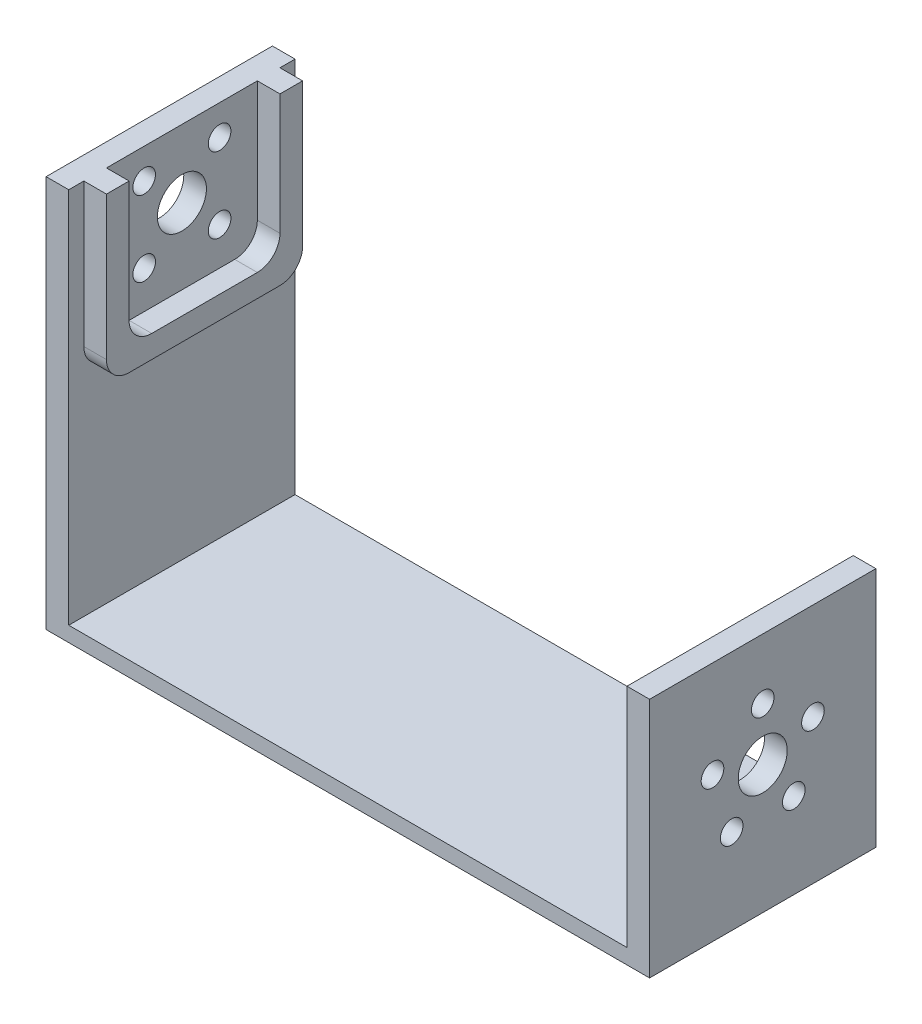
ISO-10303-21;
HEADER;
FILE_DESCRIPTION(('STEP AP214'),'2;1');
FILE_NAME('part.step','',(''),(''),'','','');
FILE_SCHEMA(('AUTOMOTIVE_DESIGN { 1 0 10303 214 1 1 1 1 }'));
ENDSEC;
DATA;
#1=APPLICATION_CONTEXT('core data for automotive mechanical design processes');
#2=APPLICATION_PROTOCOL_DEFINITION('international standard','automotive_design',2000,#1);
#3=PRODUCT_CONTEXT('',#1,'mechanical');
#4=PRODUCT('Part','Part','',(#3));
#5=PRODUCT_RELATED_PRODUCT_CATEGORY('part','',(#4));
#6=PRODUCT_DEFINITION_FORMATION('','',#4);
#7=PRODUCT_DEFINITION_CONTEXT('part definition',#1,'design');
#8=PRODUCT_DEFINITION('design','',#6,#7);
#9=PRODUCT_DEFINITION_SHAPE('','',#8);
#10=(LENGTH_UNIT() NAMED_UNIT(*) SI_UNIT(.MILLI.,.METRE.));
#11=(NAMED_UNIT(*) PLANE_ANGLE_UNIT() SI_UNIT($,.RADIAN.));
#12=(NAMED_UNIT(*) SI_UNIT($,.STERADIAN.) SOLID_ANGLE_UNIT());
#13=UNCERTAINTY_MEASURE_WITH_UNIT(LENGTH_MEASURE(1.E-05),#10,'distance_accuracy_value','');
#14=(GEOMETRIC_REPRESENTATION_CONTEXT(3) GLOBAL_UNCERTAINTY_ASSIGNED_CONTEXT((#13)) GLOBAL_UNIT_ASSIGNED_CONTEXT((#10,
#11,#12)) REPRESENTATION_CONTEXT('',''));
#15=CARTESIAN_POINT('',(0.,0.,0.));
#16=DIRECTION('',(0.,0.,1.));
#17=DIRECTION('',(1.,0.,0.));
#18=AXIS2_PLACEMENT_3D('',#15,#16,#17);
#19=CARTESIAN_POINT('',(-37.,52.,-15.));
#20=DIRECTION('',(-1.,0.,0.));
#21=DIRECTION('',(0.,0.,1.));
#22=AXIS2_PLACEMENT_3D('',#19,#20,#21);
#23=PLANE('',#22);
#24=DIRECTION('',(0.,-1.,0.));
#25=VECTOR('',#24,1.);
#26=CARTESIAN_POINT('',(-37.,52.,13.));
#27=LINE('',#26,#25);
#28=CARTESIAN_POINT('',(-37.,52.,13.));
#29=VERTEX_POINT('',#28);
#30=CARTESIAN_POINT('',(-37.,33.,13.));
#31=VERTEX_POINT('',#30);
#32=EDGE_CURVE('E226',#29,#31,#27,.T.);
#33=ORIENTED_EDGE('',*,*,#32,.F.);
#34=DIRECTION('',(0.,0.,-1.));
#35=VECTOR('',#34,1.);
#36=CARTESIAN_POINT('',(-37.,52.,-15.));
#37=LINE('',#36,#35);
#38=CARTESIAN_POINT('',(-37.,52.,15.));
#39=VERTEX_POINT('',#38);
#40=EDGE_CURVE('E377',#39,#29,#37,.T.);
#41=ORIENTED_EDGE('',*,*,#40,.F.);
#42=DIRECTION('',(0.,-1.,0.));
#43=VECTOR('',#42,1.);
#44=CARTESIAN_POINT('',(-37.,52.,15.));
#45=LINE('',#44,#43);
#46=CARTESIAN_POINT('',(-37.,2.,15.));
#47=VERTEX_POINT('',#46);
#48=EDGE_CURVE('E393',#39,#47,#45,.T.);
#49=ORIENTED_EDGE('',*,*,#48,.T.);
#50=DIRECTION('',(0.,0.,-1.));
#51=VECTOR('',#50,1.);
#52=CARTESIAN_POINT('',(-37.,2.,-15.));
#53=LINE('',#52,#51);
#54=CARTESIAN_POINT('',(-37.,2.,-15.));
#55=VERTEX_POINT('',#54);
#56=EDGE_CURVE('E369',#47,#55,#53,.T.);
#57=ORIENTED_EDGE('',*,*,#56,.T.);
#58=DIRECTION('',(0.,-1.,0.));
#59=VECTOR('',#58,1.);
#60=CARTESIAN_POINT('',(-37.,52.,-15.));
#61=LINE('',#60,#59);
#62=CARTESIAN_POINT('',(-37.,52.,-15.));
#63=VERTEX_POINT('',#62);
#64=EDGE_CURVE('E386',#63,#55,#61,.T.);
#65=ORIENTED_EDGE('',*,*,#64,.F.);
#66=CARTESIAN_POINT('',(-37.,52.,-13.));
#67=VERTEX_POINT('',#66);
#68=EDGE_CURVE('E376',#67,#63,#37,.T.);
#69=ORIENTED_EDGE('',*,*,#68,.F.);
#70=DIRECTION('',(0.,1.,0.));
#71=VECTOR('',#70,1.);
#72=CARTESIAN_POINT('',(-37.,30.,-13.));
#73=LINE('',#72,#71);
#74=CARTESIAN_POINT('',(-37.,33.,-13.));
#75=VERTEX_POINT('',#74);
#76=EDGE_CURVE('E197',#75,#67,#73,.T.);
#77=ORIENTED_EDGE('',*,*,#76,.F.);
#78=CARTESIAN_POINT('',(-37.,33.,-9.99999999999999));
#79=DIRECTION('',(-1.,0.,0.));
#80=DIRECTION('',(0.,0.,1.));
#81=AXIS2_PLACEMENT_3D('',#78,#79,#80);
#82=CIRCLE('',#81,3.);
#83=CARTESIAN_POINT('',(-37.,30.,-10.));
#84=VERTEX_POINT('',#83);
#85=EDGE_CURVE('E467',#75,#84,#82,.T.);
#86=ORIENTED_EDGE('',*,*,#85,.T.);
#87=DIRECTION('',(0.,0.,-1.));
#88=VECTOR('',#87,1.);
#89=CARTESIAN_POINT('',(-37.,30.,13.));
#90=LINE('',#89,#88);
#91=CARTESIAN_POINT('',(-37.,30.,10.));
#92=VERTEX_POINT('',#91);
#93=EDGE_CURVE('E230',#92,#84,#90,.T.);
#94=ORIENTED_EDGE('',*,*,#93,.F.);
#95=CARTESIAN_POINT('',(-37.,33.,10.));
#96=DIRECTION('',(-1.,0.,0.));
#97=DIRECTION('',(0.,0.,1.));
#98=AXIS2_PLACEMENT_3D('',#95,#96,#97);
#99=CIRCLE('',#98,3.);
#100=EDGE_CURVE('E470',#92,#31,#99,.T.);
#101=ORIENTED_EDGE('',*,*,#100,.T.);
#102=EDGE_LOOP('',(#33,#41,#49,#57,#65,#69,#77,#86,#94,#101));
#103=FACE_BOUND('',#102,.T.);
#104=ADVANCED_FACE('F39',(#103),#23,.F.);
#105=CARTESIAN_POINT('',(-37.,48.,-5.));
#106=DIRECTION('',(1.,0.,0.));
#107=DIRECTION('',(0.,0.,-1.));
#108=AXIS2_PLACEMENT_3D('',#105,#106,#107);
#109=CIRCLE('',#108,1.5);
#110=CARTESIAN_POINT('',(-37.,48.,-6.5));
#111=VERTEX_POINT('',#110);
#112=EDGE_CURVE('E323',#111,#111,#109,.T.);
#113=ORIENTED_EDGE('',*,*,#112,.F.);
#114=EDGE_LOOP('',(#113));
#115=FACE_BOUND('',#114,.T.);
#116=CARTESIAN_POINT('',(-37.,43.,0.));
#117=DIRECTION('',(1.,0.,0.));
#118=DIRECTION('',(0.,0.,-1.));
#119=AXIS2_PLACEMENT_3D('',#116,#117,#118);
#120=CIRCLE('',#119,3.25);
#121=CARTESIAN_POINT('',(-37.,43.,-3.25));
#122=VERTEX_POINT('',#121);
#123=EDGE_CURVE('E302',#122,#122,#120,.T.);
#124=ORIENTED_EDGE('',*,*,#123,.F.);
#125=EDGE_LOOP('',(#124));
#126=FACE_BOUND('',#125,.T.);
#127=CARTESIAN_POINT('',(-37.,38.,5.));
#128=DIRECTION('',(1.,0.,0.));
#129=DIRECTION('',(0.,0.,-1.));
#130=AXIS2_PLACEMENT_3D('',#127,#128,#129);
#131=CIRCLE('',#130,1.5);
#132=CARTESIAN_POINT('',(-37.,38.,3.5));
#133=VERTEX_POINT('',#132);
#134=EDGE_CURVE('E308',#133,#133,#131,.T.);
#135=ORIENTED_EDGE('',*,*,#134,.F.);
#136=EDGE_LOOP('',(#135));
#137=FACE_BOUND('',#136,.T.);
#138=CARTESIAN_POINT('',(-37.,38.,-5.));
#139=DIRECTION('',(1.,0.,0.));
#140=DIRECTION('',(0.,0.,-1.));
#141=AXIS2_PLACEMENT_3D('',#138,#139,#140);
#142=CIRCLE('',#141,1.5);
#143=CARTESIAN_POINT('',(-37.,38.,-6.5));
#144=VERTEX_POINT('',#143);
#145=EDGE_CURVE('E307',#144,#144,#142,.T.);
#146=ORIENTED_EDGE('',*,*,#145,.F.);
#147=EDGE_LOOP('',(#146));
#148=FACE_BOUND('',#147,.T.);
#149=CARTESIAN_POINT('',(-37.,48.,5.));
#150=DIRECTION('',(1.,0.,0.));
#151=DIRECTION('',(0.,0.,-1.));
#152=AXIS2_PLACEMENT_3D('',#149,#150,#151);
#153=CIRCLE('',#152,1.5);
#154=CARTESIAN_POINT('',(-37.,48.,3.5));
#155=VERTEX_POINT('',#154);
#156=EDGE_CURVE('E324',#155,#155,#153,.T.);
#157=ORIENTED_EDGE('',*,*,#156,.F.);
#158=EDGE_LOOP('',(#157));
#159=FACE_BOUND('',#158,.T.);
#160=DIRECTION('',(0.,0.,1.));
#161=VECTOR('',#160,1.);
#162=CARTESIAN_POINT('',(-37.,33.,9.99999999999999));
#163=LINE('',#162,#161);
#164=CARTESIAN_POINT('',(-37.,33.,-7.));
#165=VERTEX_POINT('',#164);
#166=CARTESIAN_POINT('',(-37.,33.,6.99999999999999));
#167=VERTEX_POINT('',#166);
#168=EDGE_CURVE('E239',#165,#167,#163,.T.);
#169=ORIENTED_EDGE('',*,*,#168,.F.);
#170=CARTESIAN_POINT('',(-37.,36.,-7.));
#171=DIRECTION('',(-1.,0.,0.));
#172=DIRECTION('',(0.,0.,1.));
#173=AXIS2_PLACEMENT_3D('',#170,#171,#172);
#174=CIRCLE('',#173,3.);
#175=CARTESIAN_POINT('',(-37.,36.,-9.99999999999999));
#176=VERTEX_POINT('',#175);
#177=EDGE_CURVE('E63',#165,#176,#174,.F.);
#178=ORIENTED_EDGE('',*,*,#177,.T.);
#179=DIRECTION('',(0.,-1.,0.));
#180=VECTOR('',#179,1.);
#181=CARTESIAN_POINT('',(-37.,33.,-9.99999999999999));
#182=LINE('',#181,#180);
#183=CARTESIAN_POINT('',(-37.,52.,-9.99999999999999));
#184=VERTEX_POINT('',#183);
#185=EDGE_CURVE('E236',#184,#176,#182,.T.);
#186=ORIENTED_EDGE('',*,*,#185,.F.);
#187=CARTESIAN_POINT('',(-37.,52.,9.99999999999999));
#188=VERTEX_POINT('',#187);
#189=EDGE_CURVE('E382',#188,#184,#37,.T.);
#190=ORIENTED_EDGE('',*,*,#189,.F.);
#191=DIRECTION('',(0.,1.,0.));
#192=VECTOR('',#191,1.);
#193=CARTESIAN_POINT('',(-37.,52.,9.99999999999999));
#194=LINE('',#193,#192);
#195=CARTESIAN_POINT('',(-37.,36.,9.99999999999999));
#196=VERTEX_POINT('',#195);
#197=EDGE_CURVE('E243',#196,#188,#194,.T.);
#198=ORIENTED_EDGE('',*,*,#197,.F.);
#199=CARTESIAN_POINT('',(-37.,36.,6.99999999999999));
#200=DIRECTION('',(-1.,0.,0.));
#201=DIRECTION('',(0.,0.,1.));
#202=AXIS2_PLACEMENT_3D('',#199,#200,#201);
#203=CIRCLE('',#202,3.);
#204=EDGE_CURVE('E55',#196,#167,#203,.F.);
#205=ORIENTED_EDGE('',*,*,#204,.T.);
#206=EDGE_LOOP('',(#169,#178,#186,#190,#198,#205));
#207=FACE_BOUND('',#206,.T.);
#208=ADVANCED_FACE('F485',(#115,#126,#137,#148,#159,#207),#23,.F.);
#209=CARTESIAN_POINT('',(0.,2.,0.));
#210=DIRECTION('',(0.,1.,0.));
#211=DIRECTION('',(0.,0.,1.));
#212=AXIS2_PLACEMENT_3D('',#209,#210,#211);
#213=PLANE('',#212);
#214=DIRECTION('',(1.,0.,0.));
#215=VECTOR('',#214,1.);
#216=CARTESIAN_POINT('',(40.,2.,15.));
#217=LINE('',#216,#215);
#218=CARTESIAN_POINT('',(37.,2.,15.));
#219=VERTEX_POINT('',#218);
#220=EDGE_CURVE('E398',#47,#219,#217,.T.);
#221=ORIENTED_EDGE('',*,*,#220,.T.);
#222=DIRECTION('',(0.,0.,1.));
#223=VECTOR('',#222,1.);
#224=CARTESIAN_POINT('',(37.,2.,-15.));
#225=LINE('',#224,#223);
#226=CARTESIAN_POINT('',(37.,2.,-15.));
#227=VERTEX_POINT('',#226);
#228=EDGE_CURVE('E339',#227,#219,#225,.T.);
#229=ORIENTED_EDGE('',*,*,#228,.F.);
#230=DIRECTION('',(-1.,0.,0.));
#231=VECTOR('',#230,1.);
#232=CARTESIAN_POINT('',(40.,2.,-15.));
#233=LINE('',#232,#231);
#234=EDGE_CURVE('E401',#227,#55,#233,.T.);
#235=ORIENTED_EDGE('',*,*,#234,.T.);
#236=ORIENTED_EDGE('',*,*,#56,.F.);
#237=EDGE_LOOP('',(#221,#229,#235,#236));
#238=FACE_BOUND('',#237,.T.);
#239=ADVANCED_FACE('F546',(#238),#213,.T.);
#240=CARTESIAN_POINT('',(-40.,2.,15.));
#241=DIRECTION('',(1.,0.,0.));
#242=DIRECTION('',(0.,0.,-1.));
#243=AXIS2_PLACEMENT_3D('',#240,#241,#242);
#244=PLANE('',#243);
#245=CARTESIAN_POINT('',(-40.,48.,5.));
#246=DIRECTION('',(1.,0.,0.));
#247=DIRECTION('',(0.,0.,-1.));
#248=AXIS2_PLACEMENT_3D('',#245,#246,#247);
#249=CIRCLE('',#248,1.5);
#250=CARTESIAN_POINT('',(-40.,48.,3.5));
#251=VERTEX_POINT('',#250);
#252=EDGE_CURVE('E319',#251,#251,#249,.T.);
#253=ORIENTED_EDGE('',*,*,#252,.T.);
#254=EDGE_LOOP('',(#253));
#255=FACE_BOUND('',#254,.T.);
#256=CARTESIAN_POINT('',(-40.,38.,-5.));
#257=DIRECTION('',(1.,0.,0.));
#258=DIRECTION('',(0.,0.,-1.));
#259=AXIS2_PLACEMENT_3D('',#256,#257,#258);
#260=CIRCLE('',#259,1.5);
#261=CARTESIAN_POINT('',(-40.,38.,-6.5));
#262=VERTEX_POINT('',#261);
#263=EDGE_CURVE('E328',#262,#262,#260,.T.);
#264=ORIENTED_EDGE('',*,*,#263,.T.);
#265=EDGE_LOOP('',(#264));
#266=FACE_BOUND('',#265,.T.);
#267=CARTESIAN_POINT('',(-40.,38.,5.));
#268=DIRECTION('',(1.,0.,0.));
#269=DIRECTION('',(0.,0.,-1.));
#270=AXIS2_PLACEMENT_3D('',#267,#268,#269);
#271=CIRCLE('',#270,1.5);
#272=CARTESIAN_POINT('',(-40.,38.,3.5));
#273=VERTEX_POINT('',#272);
#274=EDGE_CURVE('E303',#273,#273,#271,.T.);
#275=ORIENTED_EDGE('',*,*,#274,.T.);
#276=EDGE_LOOP('',(#275));
#277=FACE_BOUND('',#276,.T.);
#278=CARTESIAN_POINT('',(-40.,43.,0.));
#279=DIRECTION('',(1.,0.,0.));
#280=DIRECTION('',(0.,0.,-1.));
#281=AXIS2_PLACEMENT_3D('',#278,#279,#280);
#282=CIRCLE('',#281,3.25);
#283=CARTESIAN_POINT('',(-40.,43.,-3.25));
#284=VERTEX_POINT('',#283);
#285=EDGE_CURVE('E312',#284,#284,#282,.T.);
#286=ORIENTED_EDGE('',*,*,#285,.T.);
#287=EDGE_LOOP('',(#286));
#288=FACE_BOUND('',#287,.T.);
#289=CARTESIAN_POINT('',(-40.,48.,-5.));
#290=DIRECTION('',(1.,0.,0.));
#291=DIRECTION('',(0.,0.,-1.));
#292=AXIS2_PLACEMENT_3D('',#289,#290,#291);
#293=CIRCLE('',#292,1.5);
#294=CARTESIAN_POINT('',(-40.,48.,-6.5));
#295=VERTEX_POINT('',#294);
#296=EDGE_CURVE('E335',#295,#295,#293,.T.);
#297=ORIENTED_EDGE('',*,*,#296,.T.);
#298=EDGE_LOOP('',(#297));
#299=FACE_BOUND('',#298,.T.);
#300=DIRECTION('',(0.,0.,1.));
#301=VECTOR('',#300,1.);
#302=CARTESIAN_POINT('',(-40.,0.,15.));
#303=LINE('',#302,#301);
#304=CARTESIAN_POINT('',(-40.,0.,-15.));
#305=VERTEX_POINT('',#304);
#306=CARTESIAN_POINT('',(-40.,0.,15.));
#307=VERTEX_POINT('',#306);
#308=EDGE_CURVE('E397',#305,#307,#303,.T.);
#309=ORIENTED_EDGE('',*,*,#308,.T.);
#310=DIRECTION('',(0.,-1.,0.));
#311=VECTOR('',#310,1.);
#312=CARTESIAN_POINT('',(-40.,2.,15.));
#313=LINE('',#312,#311);
#314=CARTESIAN_POINT('',(-40.,52.,15.));
#315=VERTEX_POINT('',#314);
#316=EDGE_CURVE('E428',#315,#307,#313,.T.);
#317=ORIENTED_EDGE('',*,*,#316,.F.);
#318=DIRECTION('',(0.,0.,1.));
#319=VECTOR('',#318,1.);
#320=CARTESIAN_POINT('',(-40.,52.,-15.));
#321=LINE('',#320,#319);
#322=CARTESIAN_POINT('',(-40.,52.,-15.));
#323=VERTEX_POINT('',#322);
#324=EDGE_CURVE('E370',#323,#315,#321,.T.);
#325=ORIENTED_EDGE('',*,*,#324,.F.);
#326=DIRECTION('',(0.,-1.,0.));
#327=VECTOR('',#326,1.);
#328=CARTESIAN_POINT('',(-40.,2.,-15.));
#329=LINE('',#328,#327);
#330=EDGE_CURVE('E405',#323,#305,#329,.T.);
#331=ORIENTED_EDGE('',*,*,#330,.T.);
#332=EDGE_LOOP('',(#309,#317,#325,#331));
#333=FACE_BOUND('',#332,.T.);
#334=ADVANCED_FACE('F501',(#255,#266,#277,#288,#299,#333),#244,.F.);
#335=CARTESIAN_POINT('',(40.,2.,15.));
#336=DIRECTION('',(0.,0.,-1.));
#337=DIRECTION('',(-1.,0.,0.));
#338=AXIS2_PLACEMENT_3D('',#335,#336,#337);
#339=PLANE('',#338);
#340=DIRECTION('',(1.,0.,0.));
#341=VECTOR('',#340,1.);
#342=CARTESIAN_POINT('',(40.,0.,15.));
#343=LINE('',#342,#341);
#344=CARTESIAN_POINT('',(40.,0.,15.));
#345=VERTEX_POINT('',#344);
#346=EDGE_CURVE('E409',#307,#345,#343,.T.);
#347=ORIENTED_EDGE('',*,*,#346,.T.);
#348=DIRECTION('',(0.,-1.,0.));
#349=VECTOR('',#348,1.);
#350=CARTESIAN_POINT('',(40.,2.,15.));
#351=LINE('',#350,#349);
#352=CARTESIAN_POINT('',(40.,32.,15.));
#353=VERTEX_POINT('',#352);
#354=EDGE_CURVE('E424',#353,#345,#351,.T.);
#355=ORIENTED_EDGE('',*,*,#354,.F.);
#356=DIRECTION('',(1.,0.,0.));
#357=VECTOR('',#356,1.);
#358=CARTESIAN_POINT('',(37.,32.,15.));
#359=LINE('',#358,#357);
#360=CARTESIAN_POINT('',(37.,32.,15.));
#361=VERTEX_POINT('',#360);
#362=EDGE_CURVE('E347',#361,#353,#359,.T.);
#363=ORIENTED_EDGE('',*,*,#362,.F.);
#364=DIRECTION('',(0.,-1.,0.));
#365=VECTOR('',#364,1.);
#366=CARTESIAN_POINT('',(37.,32.,15.));
#367=LINE('',#366,#365);
#368=EDGE_CURVE('E365',#361,#219,#367,.T.);
#369=ORIENTED_EDGE('',*,*,#368,.T.);
#370=ORIENTED_EDGE('',*,*,#220,.F.);
#371=ORIENTED_EDGE('',*,*,#48,.F.);
#372=DIRECTION('',(1.,0.,0.));
#373=VECTOR('',#372,1.);
#374=CARTESIAN_POINT('',(-40.,52.,15.));
#375=LINE('',#374,#373);
#376=EDGE_CURVE('E373',#315,#39,#375,.T.);
#377=ORIENTED_EDGE('',*,*,#376,.F.);
#378=ORIENTED_EDGE('',*,*,#316,.T.);
#379=EDGE_LOOP('',(#347,#355,#363,#369,#370,#371,#377,#378));
#380=FACE_BOUND('',#379,.T.);
#381=ADVANCED_FACE('F507',(#380),#339,.F.);
#382=CARTESIAN_POINT('',(40.,2.,15.));
#383=DIRECTION('',(-1.,0.,0.));
#384=DIRECTION('',(0.,0.,1.));
#385=AXIS2_PLACEMENT_3D('',#382,#383,#384);
#386=PLANE('',#385);
#387=CARTESIAN_POINT('',(40.,24.,0.));
#388=DIRECTION('',(1.,0.,0.));
#389=DIRECTION('',(0.,0.,-1.));
#390=AXIS2_PLACEMENT_3D('',#387,#388,#389);
#391=CIRCLE('',#390,1.5);
#392=CARTESIAN_POINT('',(40.,24.,-1.5));
#393=VERTEX_POINT('',#392);
#394=EDGE_CURVE('E267',#393,#393,#391,.T.);
#395=ORIENTED_EDGE('',*,*,#394,.F.);
#396=EDGE_LOOP('',(#395));
#397=FACE_BOUND('',#396,.T.);
#398=CARTESIAN_POINT('',(40.,19.1631189606246,-6.65739561406607));
#399=DIRECTION('',(1.,0.,0.));
#400=DIRECTION('',(0.,0.,-1.));
#401=AXIS2_PLACEMENT_3D('',#398,#399,#400);
#402=CIRCLE('',#401,1.5);
#403=CARTESIAN_POINT('',(40.,19.1631189606246,-8.15739561406608));
#404=VERTEX_POINT('',#403);
#405=EDGE_CURVE('E268',#404,#404,#402,.T.);
#406=ORIENTED_EDGE('',*,*,#405,.F.);
#407=EDGE_LOOP('',(#406));
#408=FACE_BOUND('',#407,.T.);
#409=CARTESIAN_POINT('',(40.,11.3368810393754,-4.11449676604731));
#410=DIRECTION('',(1.,0.,0.));
#411=DIRECTION('',(0.,0.,-1.));
#412=AXIS2_PLACEMENT_3D('',#409,#410,#411);
#413=CIRCLE('',#412,1.5);
#414=CARTESIAN_POINT('',(40.,11.3368810393754,-5.61449676604731));
#415=VERTEX_POINT('',#414);
#416=EDGE_CURVE('E277',#415,#415,#413,.T.);
#417=ORIENTED_EDGE('',*,*,#416,.F.);
#418=EDGE_LOOP('',(#417));
#419=FACE_BOUND('',#418,.T.);
#420=CARTESIAN_POINT('',(40.,11.3368810393754,4.11449676604731));
#421=DIRECTION('',(1.,0.,0.));
#422=DIRECTION('',(0.,0.,-1.));
#423=AXIS2_PLACEMENT_3D('',#420,#421,#422);
#424=CIRCLE('',#423,1.5);
#425=CARTESIAN_POINT('',(40.,11.3368810393754,2.61449676604731));
#426=VERTEX_POINT('',#425);
#427=EDGE_CURVE('E285',#426,#426,#424,.T.);
#428=ORIENTED_EDGE('',*,*,#427,.F.);
#429=EDGE_LOOP('',(#428));
#430=FACE_BOUND('',#429,.T.);
#431=CARTESIAN_POINT('',(40.,19.1631189606246,6.65739561406608));
#432=DIRECTION('',(1.,0.,0.));
#433=DIRECTION('',(0.,0.,-1.));
#434=AXIS2_PLACEMENT_3D('',#431,#432,#433);
#435=CIRCLE('',#434,1.5);
#436=CARTESIAN_POINT('',(40.,19.1631189606246,5.15739561406607));
#437=VERTEX_POINT('',#436);
#438=EDGE_CURVE('E258',#437,#437,#435,.T.);
#439=ORIENTED_EDGE('',*,*,#438,.F.);
#440=EDGE_LOOP('',(#439));
#441=FACE_BOUND('',#440,.T.);
#442=CARTESIAN_POINT('',(40.,17.,0.));
#443=DIRECTION('',(1.,0.,0.));
#444=DIRECTION('',(0.,0.,-1.));
#445=AXIS2_PLACEMENT_3D('',#442,#443,#444);
#446=CIRCLE('',#445,3.25);
#447=CARTESIAN_POINT('',(40.,17.,-3.25));
#448=VERTEX_POINT('',#447);
#449=EDGE_CURVE('E298',#448,#448,#446,.T.);
#450=ORIENTED_EDGE('',*,*,#449,.F.);
#451=EDGE_LOOP('',(#450));
#452=FACE_BOUND('',#451,.T.);
#453=DIRECTION('',(0.,0.,-1.));
#454=VECTOR('',#453,1.);
#455=CARTESIAN_POINT('',(40.,0.,15.));
#456=LINE('',#455,#454);
#457=CARTESIAN_POINT('',(40.,0.,-15.));
#458=VERTEX_POINT('',#457);
#459=EDGE_CURVE('E412',#345,#458,#456,.T.);
#460=ORIENTED_EDGE('',*,*,#459,.T.);
#461=DIRECTION('',(0.,-1.,0.));
#462=VECTOR('',#461,1.);
#463=CARTESIAN_POINT('',(40.,2.,-15.));
#464=LINE('',#463,#462);
#465=CARTESIAN_POINT('',(40.,32.,-15.));
#466=VERTEX_POINT('',#465);
#467=EDGE_CURVE('E420',#466,#458,#464,.T.);
#468=ORIENTED_EDGE('',*,*,#467,.F.);
#469=DIRECTION('',(0.,0.,-1.));
#470=VECTOR('',#469,1.);
#471=CARTESIAN_POINT('',(40.,32.,-15.));
#472=LINE('',#471,#470);
#473=EDGE_CURVE('E351',#353,#466,#472,.T.);
#474=ORIENTED_EDGE('',*,*,#473,.F.);
#475=ORIENTED_EDGE('',*,*,#354,.T.);
#476=EDGE_LOOP('',(#460,#468,#474,#475));
#477=FACE_BOUND('',#476,.T.);
#478=ADVANCED_FACE('F558',(#397,#408,#419,#430,#441,#452,#477),#386,.F.);
#479=CARTESIAN_POINT('',(40.,2.,-15.));
#480=DIRECTION('',(0.,0.,1.));
#481=DIRECTION('',(1.,0.,0.));
#482=AXIS2_PLACEMENT_3D('',#479,#480,#481);
#483=PLANE('',#482);
#484=DIRECTION('',(-1.,0.,0.));
#485=VECTOR('',#484,1.);
#486=CARTESIAN_POINT('',(40.,0.,-15.));
#487=LINE('',#486,#485);
#488=EDGE_CURVE('E402',#458,#305,#487,.T.);
#489=ORIENTED_EDGE('',*,*,#488,.T.);
#490=ORIENTED_EDGE('',*,*,#330,.F.);
#491=DIRECTION('',(-1.,0.,0.));
#492=VECTOR('',#491,1.);
#493=CARTESIAN_POINT('',(-40.,52.,-15.));
#494=LINE('',#493,#492);
#495=EDGE_CURVE('E381',#63,#323,#494,.T.);
#496=ORIENTED_EDGE('',*,*,#495,.F.);
#497=ORIENTED_EDGE('',*,*,#64,.T.);
#498=ORIENTED_EDGE('',*,*,#234,.F.);
#499=DIRECTION('',(0.,-1.,0.));
#500=VECTOR('',#499,1.);
#501=CARTESIAN_POINT('',(37.,32.,-15.));
#502=LINE('',#501,#500);
#503=CARTESIAN_POINT('',(37.,32.,-15.));
#504=VERTEX_POINT('',#503);
#505=EDGE_CURVE('E358',#504,#227,#502,.T.);
#506=ORIENTED_EDGE('',*,*,#505,.F.);
#507=DIRECTION('',(-1.,0.,0.));
#508=VECTOR('',#507,1.);
#509=CARTESIAN_POINT('',(37.,32.,-15.));
#510=LINE('',#509,#508);
#511=EDGE_CURVE('E355',#466,#504,#510,.T.);
#512=ORIENTED_EDGE('',*,*,#511,.F.);
#513=ORIENTED_EDGE('',*,*,#467,.T.);
#514=EDGE_LOOP('',(#489,#490,#496,#497,#498,#506,#512,#513));
#515=FACE_BOUND('',#514,.T.);
#516=ADVANCED_FACE('F497',(#515),#483,.F.);
#517=CARTESIAN_POINT('',(0.,0.,0.));
#518=DIRECTION('',(0.,1.,0.));
#519=DIRECTION('',(0.,0.,1.));
#520=AXIS2_PLACEMENT_3D('',#517,#518,#519);
#521=PLANE('',#520);
#522=ORIENTED_EDGE('',*,*,#308,.F.);
#523=ORIENTED_EDGE('',*,*,#488,.F.);
#524=ORIENTED_EDGE('',*,*,#459,.F.);
#525=ORIENTED_EDGE('',*,*,#346,.F.);
#526=EDGE_LOOP('',(#522,#523,#524,#525));
#527=FACE_BOUND('',#526,.T.);
#528=ADVANCED_FACE('F503',(#527),#521,.F.);
#529=CARTESIAN_POINT('',(0.,52.,0.));
#530=DIRECTION('',(0.,1.,0.));
#531=DIRECTION('',(0.,0.,1.));
#532=AXIS2_PLACEMENT_3D('',#529,#530,#531);
#533=PLANE('',#532);
#534=ORIENTED_EDGE('',*,*,#324,.T.);
#535=ORIENTED_EDGE('',*,*,#376,.T.);
#536=ORIENTED_EDGE('',*,*,#40,.T.);
#537=DIRECTION('',(-1.,0.,0.));
#538=VECTOR('',#537,1.);
#539=CARTESIAN_POINT('',(-34.,52.,13.));
#540=LINE('',#539,#538);
#541=CARTESIAN_POINT('',(-34.,52.,13.));
#542=VERTEX_POINT('',#541);
#543=EDGE_CURVE('E225',#542,#29,#540,.T.);
#544=ORIENTED_EDGE('',*,*,#543,.F.);
#545=DIRECTION('',(0.,0.,1.));
#546=VECTOR('',#545,1.);
#547=CARTESIAN_POINT('',(-34.,52.,13.));
#548=LINE('',#547,#546);
#549=CARTESIAN_POINT('',(-34.,52.,9.99999999999999));
#550=VERTEX_POINT('',#549);
#551=EDGE_CURVE('E222',#550,#542,#548,.T.);
#552=ORIENTED_EDGE('',*,*,#551,.F.);
#553=DIRECTION('',(-1.,0.,0.));
#554=VECTOR('',#553,1.);
#555=CARTESIAN_POINT('',(-34.,52.,9.99999999999999));
#556=LINE('',#555,#554);
#557=EDGE_CURVE('E249',#550,#188,#556,.T.);
#558=ORIENTED_EDGE('',*,*,#557,.T.);
#559=ORIENTED_EDGE('',*,*,#189,.T.);
#560=DIRECTION('',(-1.,0.,0.));
#561=VECTOR('',#560,1.);
#562=CARTESIAN_POINT('',(-34.,52.,-9.99999999999999));
#563=LINE('',#562,#561);
#564=CARTESIAN_POINT('',(-34.,52.,-9.99999999999999));
#565=VERTEX_POINT('',#564);
#566=EDGE_CURVE('E202',#565,#184,#563,.T.);
#567=ORIENTED_EDGE('',*,*,#566,.F.);
#568=DIRECTION('',(0.,0.,1.));
#569=VECTOR('',#568,1.);
#570=CARTESIAN_POINT('',(-34.,52.,-13.));
#571=LINE('',#570,#569);
#572=CARTESIAN_POINT('',(-34.,52.,-13.));
#573=VERTEX_POINT('',#572);
#574=EDGE_CURVE('E183',#573,#565,#571,.T.);
#575=ORIENTED_EDGE('',*,*,#574,.F.);
#576=DIRECTION('',(-1.,0.,0.));
#577=VECTOR('',#576,1.);
#578=CARTESIAN_POINT('',(-34.,52.,-13.));
#579=LINE('',#578,#577);
#580=EDGE_CURVE('E194',#573,#67,#579,.T.);
#581=ORIENTED_EDGE('',*,*,#580,.T.);
#582=ORIENTED_EDGE('',*,*,#68,.T.);
#583=ORIENTED_EDGE('',*,*,#495,.T.);
#584=EDGE_LOOP('',(#534,#535,#536,#544,#552,#558,#559,#567,#575,#581,#582,#583));
#585=FACE_BOUND('',#584,.T.);
#586=ADVANCED_FACE('F205',(#585),#533,.T.);
#587=CARTESIAN_POINT('',(37.,32.,-15.));
#588=DIRECTION('',(1.,0.,0.));
#589=DIRECTION('',(0.,0.,-1.));
#590=AXIS2_PLACEMENT_3D('',#587,#588,#589);
#591=PLANE('',#590);
#592=CARTESIAN_POINT('',(37.,24.,0.));
#593=DIRECTION('',(1.,0.,0.));
#594=DIRECTION('',(0.,0.,-1.));
#595=AXIS2_PLACEMENT_3D('',#592,#593,#594);
#596=CIRCLE('',#595,1.5);
#597=CARTESIAN_POINT('',(37.,24.,-1.5));
#598=VERTEX_POINT('',#597);
#599=EDGE_CURVE('E263',#598,#598,#596,.F.);
#600=ORIENTED_EDGE('',*,*,#599,.F.);
#601=EDGE_LOOP('',(#600));
#602=FACE_BOUND('',#601,.T.);
#603=CARTESIAN_POINT('',(37.,19.1631189606246,-6.65739561406607));
#604=DIRECTION('',(1.,0.,0.));
#605=DIRECTION('',(0.,0.,-1.));
#606=AXIS2_PLACEMENT_3D('',#603,#604,#605);
#607=CIRCLE('',#606,1.5);
#608=CARTESIAN_POINT('',(37.,19.1631189606246,-8.15739561406608));
#609=VERTEX_POINT('',#608);
#610=EDGE_CURVE('E273',#609,#609,#607,.F.);
#611=ORIENTED_EDGE('',*,*,#610,.F.);
#612=EDGE_LOOP('',(#611));
#613=FACE_BOUND('',#612,.T.);
#614=CARTESIAN_POINT('',(37.,11.3368810393754,-4.11449676604731));
#615=DIRECTION('',(1.,0.,0.));
#616=DIRECTION('',(0.,0.,-1.));
#617=AXIS2_PLACEMENT_3D('',#614,#615,#616);
#618=CIRCLE('',#617,1.5);
#619=CARTESIAN_POINT('',(37.,11.3368810393754,-5.61449676604731));
#620=VERTEX_POINT('',#619);
#621=EDGE_CURVE('E281',#620,#620,#618,.F.);
#622=ORIENTED_EDGE('',*,*,#621,.F.);
#623=EDGE_LOOP('',(#622));
#624=FACE_BOUND('',#623,.T.);
#625=CARTESIAN_POINT('',(37.,11.3368810393754,4.11449676604731));
#626=DIRECTION('',(1.,0.,0.));
#627=DIRECTION('',(0.,0.,-1.));
#628=AXIS2_PLACEMENT_3D('',#625,#626,#627);
#629=CIRCLE('',#628,1.5);
#630=CARTESIAN_POINT('',(37.,11.3368810393754,2.61449676604731));
#631=VERTEX_POINT('',#630);
#632=EDGE_CURVE('E262',#631,#631,#629,.F.);
#633=ORIENTED_EDGE('',*,*,#632,.F.);
#634=EDGE_LOOP('',(#633));
#635=FACE_BOUND('',#634,.T.);
#636=CARTESIAN_POINT('',(37.,19.1631189606246,6.65739561406608));
#637=DIRECTION('',(1.,0.,0.));
#638=DIRECTION('',(0.,0.,-1.));
#639=AXIS2_PLACEMENT_3D('',#636,#637,#638);
#640=CIRCLE('',#639,1.5);
#641=CARTESIAN_POINT('',(37.,19.1631189606246,5.15739561406607));
#642=VERTEX_POINT('',#641);
#643=EDGE_CURVE('E201',#642,#642,#640,.F.);
#644=ORIENTED_EDGE('',*,*,#643,.F.);
#645=EDGE_LOOP('',(#644));
#646=FACE_BOUND('',#645,.T.);
#647=CARTESIAN_POINT('',(37.,17.,0.));
#648=DIRECTION('',(1.,0.,0.));
#649=DIRECTION('',(0.,0.,-1.));
#650=AXIS2_PLACEMENT_3D('',#647,#648,#649);
#651=CIRCLE('',#650,3.25);
#652=CARTESIAN_POINT('',(37.,17.,-3.25));
#653=VERTEX_POINT('',#652);
#654=EDGE_CURVE('E272',#653,#653,#651,.F.);
#655=ORIENTED_EDGE('',*,*,#654,.F.);
#656=EDGE_LOOP('',(#655));
#657=FACE_BOUND('',#656,.T.);
#658=ORIENTED_EDGE('',*,*,#228,.T.);
#659=ORIENTED_EDGE('',*,*,#368,.F.);
#660=DIRECTION('',(0.,0.,1.));
#661=VECTOR('',#660,1.);
#662=CARTESIAN_POINT('',(37.,32.,-15.));
#663=LINE('',#662,#661);
#664=EDGE_CURVE('E343',#504,#361,#663,.T.);
#665=ORIENTED_EDGE('',*,*,#664,.F.);
#666=ORIENTED_EDGE('',*,*,#505,.T.);
#667=EDGE_LOOP('',(#658,#659,#665,#666));
#668=FACE_BOUND('',#667,.T.);
#669=ADVANCED_FACE('F613',(#602,#613,#624,#635,#646,#657,#668),#591,.F.);
#670=CARTESIAN_POINT('',(0.,32.,0.));
#671=DIRECTION('',(0.,1.,0.));
#672=DIRECTION('',(0.,0.,1.));
#673=AXIS2_PLACEMENT_3D('',#670,#671,#672);
#674=PLANE('',#673);
#675=ORIENTED_EDGE('',*,*,#664,.T.);
#676=ORIENTED_EDGE('',*,*,#362,.T.);
#677=ORIENTED_EDGE('',*,*,#473,.T.);
#678=ORIENTED_EDGE('',*,*,#511,.T.);
#679=EDGE_LOOP('',(#675,#676,#677,#678));
#680=FACE_BOUND('',#679,.T.);
#681=ADVANCED_FACE('F581',(#680),#674,.T.);
#682=CARTESIAN_POINT('',(-40.,48.,-5.));
#683=DIRECTION('',(1.,0.,0.));
#684=DIRECTION('',(0.,0.,-1.));
#685=AXIS2_PLACEMENT_3D('',#682,#683,#684);
#686=CYLINDRICAL_SURFACE('',#685,1.5);
#687=ORIENTED_EDGE('',*,*,#296,.F.);
#688=EDGE_LOOP('',(#687));
#689=FACE_BOUND('',#688,.T.);
#690=ORIENTED_EDGE('',*,*,#112,.T.);
#691=EDGE_LOOP('',(#690));
#692=FACE_BOUND('',#691,.T.);
#693=ADVANCED_FACE('F577',(#689,#692),#686,.F.);
#694=CARTESIAN_POINT('',(-40.,43.,0.));
#695=DIRECTION('',(1.,0.,0.));
#696=DIRECTION('',(0.,0.,-1.));
#697=AXIS2_PLACEMENT_3D('',#694,#695,#696);
#698=CYLINDRICAL_SURFACE('',#697,3.25);
#699=ORIENTED_EDGE('',*,*,#285,.F.);
#700=EDGE_LOOP('',(#699));
#701=FACE_BOUND('',#700,.T.);
#702=ORIENTED_EDGE('',*,*,#123,.T.);
#703=EDGE_LOOP('',(#702));
#704=FACE_BOUND('',#703,.T.);
#705=ADVANCED_FACE('F580',(#701,#704),#698,.F.);
#706=CARTESIAN_POINT('',(-40.,38.,5.));
#707=DIRECTION('',(1.,0.,0.));
#708=DIRECTION('',(0.,0.,-1.));
#709=AXIS2_PLACEMENT_3D('',#706,#707,#708);
#710=CYLINDRICAL_SURFACE('',#709,1.5);
#711=ORIENTED_EDGE('',*,*,#274,.F.);
#712=EDGE_LOOP('',(#711));
#713=FACE_BOUND('',#712,.T.);
#714=ORIENTED_EDGE('',*,*,#134,.T.);
#715=EDGE_LOOP('',(#714));
#716=FACE_BOUND('',#715,.T.);
#717=ADVANCED_FACE('F606',(#713,#716),#710,.F.);
#718=CARTESIAN_POINT('',(-40.,38.,-5.));
#719=DIRECTION('',(1.,0.,0.));
#720=DIRECTION('',(0.,0.,-1.));
#721=AXIS2_PLACEMENT_3D('',#718,#719,#720);
#722=CYLINDRICAL_SURFACE('',#721,1.5);
#723=ORIENTED_EDGE('',*,*,#263,.F.);
#724=EDGE_LOOP('',(#723));
#725=FACE_BOUND('',#724,.T.);
#726=ORIENTED_EDGE('',*,*,#145,.T.);
#727=EDGE_LOOP('',(#726));
#728=FACE_BOUND('',#727,.T.);
#729=ADVANCED_FACE('F596',(#725,#728),#722,.F.);
#730=CARTESIAN_POINT('',(-40.,48.,5.));
#731=DIRECTION('',(1.,0.,0.));
#732=DIRECTION('',(0.,0.,-1.));
#733=AXIS2_PLACEMENT_3D('',#730,#731,#732);
#734=CYLINDRICAL_SURFACE('',#733,1.5);
#735=ORIENTED_EDGE('',*,*,#252,.F.);
#736=EDGE_LOOP('',(#735));
#737=FACE_BOUND('',#736,.T.);
#738=ORIENTED_EDGE('',*,*,#156,.T.);
#739=EDGE_LOOP('',(#738));
#740=FACE_BOUND('',#739,.T.);
#741=ADVANCED_FACE('F593',(#737,#740),#734,.F.);
#742=CARTESIAN_POINT('',(-40.001,17.,0.));
#743=DIRECTION('',(1.,0.,0.));
#744=DIRECTION('',(0.,0.,-1.));
#745=AXIS2_PLACEMENT_3D('',#742,#743,#744);
#746=CYLINDRICAL_SURFACE('',#745,3.25);
#747=ORIENTED_EDGE('',*,*,#449,.T.);
#748=EDGE_LOOP('',(#747));
#749=FACE_BOUND('',#748,.T.);
#750=ORIENTED_EDGE('',*,*,#654,.T.);
#751=EDGE_LOOP('',(#750));
#752=FACE_BOUND('',#751,.T.);
#753=ADVANCED_FACE('F595',(#749,#752),#746,.F.);
#754=CARTESIAN_POINT('',(-40.001,19.1631189606246,6.65739561406608));
#755=DIRECTION('',(1.,0.,0.));
#756=DIRECTION('',(0.,0.,-1.));
#757=AXIS2_PLACEMENT_3D('',#754,#755,#756);
#758=CYLINDRICAL_SURFACE('',#757,1.5);
#759=ORIENTED_EDGE('',*,*,#438,.T.);
#760=EDGE_LOOP('',(#759));
#761=FACE_BOUND('',#760,.T.);
#762=ORIENTED_EDGE('',*,*,#643,.T.);
#763=EDGE_LOOP('',(#762));
#764=FACE_BOUND('',#763,.T.);
#765=ADVANCED_FACE('F603',(#761,#764),#758,.F.);
#766=CARTESIAN_POINT('',(-40.001,11.3368810393754,4.11449676604731));
#767=DIRECTION('',(1.,0.,0.));
#768=DIRECTION('',(0.,0.,-1.));
#769=AXIS2_PLACEMENT_3D('',#766,#767,#768);
#770=CYLINDRICAL_SURFACE('',#769,1.5);
#771=ORIENTED_EDGE('',*,*,#427,.T.);
#772=EDGE_LOOP('',(#771));
#773=FACE_BOUND('',#772,.T.);
#774=ORIENTED_EDGE('',*,*,#632,.T.);
#775=EDGE_LOOP('',(#774));
#776=FACE_BOUND('',#775,.T.);
#777=ADVANCED_FACE('F642',(#773,#776),#770,.F.);
#778=CARTESIAN_POINT('',(-40.001,11.3368810393754,-4.11449676604731));
#779=DIRECTION('',(1.,0.,0.));
#780=DIRECTION('',(0.,0.,-1.));
#781=AXIS2_PLACEMENT_3D('',#778,#779,#780);
#782=CYLINDRICAL_SURFACE('',#781,1.5);
#783=ORIENTED_EDGE('',*,*,#416,.T.);
#784=EDGE_LOOP('',(#783));
#785=FACE_BOUND('',#784,.T.);
#786=ORIENTED_EDGE('',*,*,#621,.T.);
#787=EDGE_LOOP('',(#786));
#788=FACE_BOUND('',#787,.T.);
#789=ADVANCED_FACE('F648',(#785,#788),#782,.F.);
#790=CARTESIAN_POINT('',(-40.001,19.1631189606246,-6.65739561406607));
#791=DIRECTION('',(1.,0.,0.));
#792=DIRECTION('',(0.,0.,-1.));
#793=AXIS2_PLACEMENT_3D('',#790,#791,#792);
#794=CYLINDRICAL_SURFACE('',#793,1.5);
#795=ORIENTED_EDGE('',*,*,#405,.T.);
#796=EDGE_LOOP('',(#795));
#797=FACE_BOUND('',#796,.T.);
#798=ORIENTED_EDGE('',*,*,#610,.T.);
#799=EDGE_LOOP('',(#798));
#800=FACE_BOUND('',#799,.T.);
#801=ADVANCED_FACE('F657',(#797,#800),#794,.F.);
#802=CARTESIAN_POINT('',(-40.001,24.,0.));
#803=DIRECTION('',(1.,0.,0.));
#804=DIRECTION('',(0.,0.,-1.));
#805=AXIS2_PLACEMENT_3D('',#802,#803,#804);
#806=CYLINDRICAL_SURFACE('',#805,1.5);
#807=ORIENTED_EDGE('',*,*,#394,.T.);
#808=EDGE_LOOP('',(#807));
#809=FACE_BOUND('',#808,.T.);
#810=ORIENTED_EDGE('',*,*,#599,.T.);
#811=EDGE_LOOP('',(#810));
#812=FACE_BOUND('',#811,.T.);
#813=ADVANCED_FACE('F654',(#809,#812),#806,.F.);
#814=CARTESIAN_POINT('',(-34.,52.,13.));
#815=DIRECTION('',(0.,0.,-1.));
#816=DIRECTION('',(0.,1.,0.));
#817=AXIS2_PLACEMENT_3D('',#814,#815,#816);
#818=PLANE('',#817);
#819=ORIENTED_EDGE('',*,*,#32,.T.);
#820=DIRECTION('',(-1.,0.,0.));
#821=VECTOR('',#820,1.);
#822=CARTESIAN_POINT('',(-34.,33.,13.));
#823=LINE('',#822,#821);
#824=CARTESIAN_POINT('',(-34.,33.,13.));
#825=VERTEX_POINT('',#824);
#826=EDGE_CURVE('E447',#31,#825,#823,.F.);
#827=ORIENTED_EDGE('',*,*,#826,.T.);
#828=DIRECTION('',(0.,-1.,0.));
#829=VECTOR('',#828,1.);
#830=CARTESIAN_POINT('',(-34.,52.,13.));
#831=LINE('',#830,#829);
#832=EDGE_CURVE('E246',#542,#825,#831,.T.);
#833=ORIENTED_EDGE('',*,*,#832,.F.);
#834=ORIENTED_EDGE('',*,*,#543,.T.);
#835=EDGE_LOOP('',(#819,#827,#833,#834));
#836=FACE_BOUND('',#835,.T.);
#837=ADVANCED_FACE('F516',(#836),#818,.F.);
#838=CARTESIAN_POINT('',(-34.,30.,13.));
#839=DIRECTION('',(0.,1.,0.));
#840=DIRECTION('',(0.,0.,1.));
#841=AXIS2_PLACEMENT_3D('',#838,#839,#840);
#842=PLANE('',#841);
#843=ORIENTED_EDGE('',*,*,#93,.T.);
#844=DIRECTION('',(-1.,0.,0.));
#845=VECTOR('',#844,1.);
#846=CARTESIAN_POINT('',(-34.,30.,-10.));
#847=LINE('',#846,#845);
#848=CARTESIAN_POINT('',(-34.,30.,-10.));
#849=VERTEX_POINT('',#848);
#850=EDGE_CURVE('E439',#84,#849,#847,.F.);
#851=ORIENTED_EDGE('',*,*,#850,.T.);
#852=DIRECTION('',(0.,0.,-1.));
#853=VECTOR('',#852,1.);
#854=CARTESIAN_POINT('',(-34.,30.,13.));
#855=LINE('',#854,#853);
#856=CARTESIAN_POINT('',(-34.,30.,10.));
#857=VERTEX_POINT('',#856);
#858=EDGE_CURVE('E191',#857,#849,#855,.T.);
#859=ORIENTED_EDGE('',*,*,#858,.F.);
#860=DIRECTION('',(-1.,0.,0.));
#861=VECTOR('',#860,1.);
#862=CARTESIAN_POINT('',(-34.,30.,10.));
#863=LINE('',#862,#861);
#864=EDGE_CURVE('E435',#857,#92,#863,.T.);
#865=ORIENTED_EDGE('',*,*,#864,.T.);
#866=EDGE_LOOP('',(#843,#851,#859,#865));
#867=FACE_BOUND('',#866,.T.);
#868=ADVANCED_FACE('F524',(#867),#842,.F.);
#869=CARTESIAN_POINT('',(-34.,30.,-13.));
#870=DIRECTION('',(0.,0.,1.));
#871=DIRECTION('',(0.,-1.,0.));
#872=AXIS2_PLACEMENT_3D('',#869,#870,#871);
#873=PLANE('',#872);
#874=DIRECTION('',(0.,1.,0.));
#875=VECTOR('',#874,1.);
#876=CARTESIAN_POINT('',(-34.,30.,-13.));
#877=LINE('',#876,#875);
#878=CARTESIAN_POINT('',(-34.,33.,-13.));
#879=VERTEX_POINT('',#878);
#880=EDGE_CURVE('E177',#879,#573,#877,.T.);
#881=ORIENTED_EDGE('',*,*,#880,.F.);
#882=DIRECTION('',(-1.,0.,0.));
#883=VECTOR('',#882,1.);
#884=CARTESIAN_POINT('',(-34.,33.,-13.));
#885=LINE('',#884,#883);
#886=EDGE_CURVE('E432',#879,#75,#885,.T.);
#887=ORIENTED_EDGE('',*,*,#886,.T.);
#888=ORIENTED_EDGE('',*,*,#76,.T.);
#889=ORIENTED_EDGE('',*,*,#580,.F.);
#890=EDGE_LOOP('',(#881,#887,#888,#889));
#891=FACE_BOUND('',#890,.T.);
#892=ADVANCED_FACE('F195',(#891),#873,.F.);
#893=CARTESIAN_POINT('',(-34.,33.,-9.99999999999999));
#894=DIRECTION('',(0.,0.,-1.));
#895=DIRECTION('',(-1.,0.,0.));
#896=AXIS2_PLACEMENT_3D('',#893,#894,#895);
#897=PLANE('',#896);
#898=ORIENTED_EDGE('',*,*,#185,.T.);
#899=DIRECTION('',(-1.,0.,0.));
#900=VECTOR('',#899,1.);
#901=CARTESIAN_POINT('',(-34.,36.,-9.99999999999999));
#902=LINE('',#901,#900);
#903=CARTESIAN_POINT('',(-34.,36.,-9.99999999999999));
#904=VERTEX_POINT('',#903);
#905=EDGE_CURVE('E461',#176,#904,#902,.F.);
#906=ORIENTED_EDGE('',*,*,#905,.T.);
#907=DIRECTION('',(0.,-1.,0.));
#908=VECTOR('',#907,1.);
#909=CARTESIAN_POINT('',(-34.,33.,-9.99999999999999));
#910=LINE('',#909,#908);
#911=EDGE_CURVE('E209',#565,#904,#910,.T.);
#912=ORIENTED_EDGE('',*,*,#911,.F.);
#913=ORIENTED_EDGE('',*,*,#566,.T.);
#914=EDGE_LOOP('',(#898,#906,#912,#913));
#915=FACE_BOUND('',#914,.T.);
#916=ADVANCED_FACE('F483',(#915),#897,.F.);
#917=CARTESIAN_POINT('',(-34.,33.,9.99999999999999));
#918=DIRECTION('',(0.,-1.,0.));
#919=DIRECTION('',(0.,0.,-1.));
#920=AXIS2_PLACEMENT_3D('',#917,#918,#919);
#921=PLANE('',#920);
#922=DIRECTION('',(0.,0.,1.));
#923=VECTOR('',#922,1.);
#924=CARTESIAN_POINT('',(-34.,33.,9.99999999999999));
#925=LINE('',#924,#923);
#926=CARTESIAN_POINT('',(-34.,33.,-7.));
#927=VERTEX_POINT('',#926);
#928=CARTESIAN_POINT('',(-34.,33.,6.99999999999999));
#929=VERTEX_POINT('',#928);
#930=EDGE_CURVE('E212',#927,#929,#925,.T.);
#931=ORIENTED_EDGE('',*,*,#930,.F.);
#932=DIRECTION('',(-1.,0.,0.));
#933=VECTOR('',#932,1.);
#934=CARTESIAN_POINT('',(-37.,33.,-7.));
#935=LINE('',#934,#933);
#936=EDGE_CURVE('E453',#927,#165,#935,.T.);
#937=ORIENTED_EDGE('',*,*,#936,.T.);
#938=ORIENTED_EDGE('',*,*,#168,.T.);
#939=DIRECTION('',(-1.,0.,0.));
#940=VECTOR('',#939,1.);
#941=CARTESIAN_POINT('',(-34.,33.,6.99999999999999));
#942=LINE('',#941,#940);
#943=EDGE_CURVE('E450',#167,#929,#942,.F.);
#944=ORIENTED_EDGE('',*,*,#943,.T.);
#945=EDGE_LOOP('',(#931,#937,#938,#944));
#946=FACE_BOUND('',#945,.T.);
#947=ADVANCED_FACE('F480',(#946),#921,.F.);
#948=CARTESIAN_POINT('',(-34.,52.,9.99999999999999));
#949=DIRECTION('',(0.,0.,1.));
#950=DIRECTION('',(1.,0.,0.));
#951=AXIS2_PLACEMENT_3D('',#948,#949,#950);
#952=PLANE('',#951);
#953=DIRECTION('',(0.,1.,0.));
#954=VECTOR('',#953,1.);
#955=CARTESIAN_POINT('',(-34.,52.,9.99999999999999));
#956=LINE('',#955,#954);
#957=CARTESIAN_POINT('',(-34.,36.,9.99999999999999));
#958=VERTEX_POINT('',#957);
#959=EDGE_CURVE('E219',#958,#550,#956,.T.);
#960=ORIENTED_EDGE('',*,*,#959,.F.);
#961=DIRECTION('',(-1.,0.,0.));
#962=VECTOR('',#961,1.);
#963=CARTESIAN_POINT('',(-37.,36.,9.99999999999999));
#964=LINE('',#963,#962);
#965=EDGE_CURVE('E464',#958,#196,#964,.T.);
#966=ORIENTED_EDGE('',*,*,#965,.T.);
#967=ORIENTED_EDGE('',*,*,#197,.T.);
#968=ORIENTED_EDGE('',*,*,#557,.F.);
#969=EDGE_LOOP('',(#960,#966,#967,#968));
#970=FACE_BOUND('',#969,.T.);
#971=ADVANCED_FACE('F538',(#970),#952,.F.);
#972=CARTESIAN_POINT('',(-34.,0.,0.));
#973=DIRECTION('',(1.,0.,0.));
#974=DIRECTION('',(0.,0.,-1.));
#975=AXIS2_PLACEMENT_3D('',#972,#973,#974);
#976=PLANE('',#975);
#977=ORIENTED_EDGE('',*,*,#858,.T.);
#978=CARTESIAN_POINT('',(-34.,33.,-9.99999999999999));
#979=DIRECTION('',(1.,0.,0.));
#980=DIRECTION('',(0.,0.,-1.));
#981=AXIS2_PLACEMENT_3D('',#978,#979,#980);
#982=CIRCLE('',#981,3.);
#983=EDGE_CURVE('E186',#849,#879,#982,.T.);
#984=ORIENTED_EDGE('',*,*,#983,.T.);
#985=ORIENTED_EDGE('',*,*,#880,.T.);
#986=ORIENTED_EDGE('',*,*,#574,.T.);
#987=ORIENTED_EDGE('',*,*,#911,.T.);
#988=CARTESIAN_POINT('',(-34.,36.,-7.));
#989=DIRECTION('',(1.,0.,0.));
#990=DIRECTION('',(0.,0.,-1.));
#991=AXIS2_PLACEMENT_3D('',#988,#989,#990);
#992=CIRCLE('',#991,3.);
#993=EDGE_CURVE('E48',#904,#927,#992,.F.);
#994=ORIENTED_EDGE('',*,*,#993,.T.);
#995=ORIENTED_EDGE('',*,*,#930,.T.);
#996=CARTESIAN_POINT('',(-34.,36.,6.99999999999999));
#997=DIRECTION('',(1.,0.,0.));
#998=DIRECTION('',(0.,0.,-1.));
#999=AXIS2_PLACEMENT_3D('',#996,#997,#998);
#1000=CIRCLE('',#999,3.);
#1001=EDGE_CURVE('E11',#929,#958,#1000,.F.);
#1002=ORIENTED_EDGE('',*,*,#1001,.T.);
#1003=ORIENTED_EDGE('',*,*,#959,.T.);
#1004=ORIENTED_EDGE('',*,*,#551,.T.);
#1005=ORIENTED_EDGE('',*,*,#832,.T.);
#1006=CARTESIAN_POINT('',(-34.,33.,10.));
#1007=DIRECTION('',(1.,0.,0.));
#1008=DIRECTION('',(0.,0.,-1.));
#1009=AXIS2_PLACEMENT_3D('',#1006,#1007,#1008);
#1010=CIRCLE('',#1009,3.);
#1011=EDGE_CURVE('E442',#825,#857,#1010,.T.);
#1012=ORIENTED_EDGE('',*,*,#1011,.T.);
#1013=EDGE_LOOP('',(#977,#984,#985,#986,#987,#994,#995,#1002,#1003,#1004,#1005,#1012));
#1014=FACE_BOUND('',#1013,.T.);
#1015=ADVANCED_FACE('F180',(#1014),#976,.T.);
#1016=CARTESIAN_POINT('',(-34.,33.,-9.99999999999999));
#1017=DIRECTION('',(-1.,0.,0.));
#1018=DIRECTION('',(0.,0.,1.));
#1019=AXIS2_PLACEMENT_3D('',#1016,#1017,#1018);
#1020=CYLINDRICAL_SURFACE('',#1019,3.);
#1021=ORIENTED_EDGE('',*,*,#983,.F.);
#1022=ORIENTED_EDGE('',*,*,#850,.F.);
#1023=ORIENTED_EDGE('',*,*,#85,.F.);
#1024=ORIENTED_EDGE('',*,*,#886,.F.);
#1025=EDGE_LOOP('',(#1021,#1022,#1023,#1024));
#1026=FACE_BOUND('',#1025,.T.);
#1027=ADVANCED_FACE('F530',(#1026),#1020,.T.);
#1028=CARTESIAN_POINT('',(-34.,33.,10.));
#1029=DIRECTION('',(-1.,0.,0.));
#1030=DIRECTION('',(0.,0.,1.));
#1031=AXIS2_PLACEMENT_3D('',#1028,#1029,#1030);
#1032=CYLINDRICAL_SURFACE('',#1031,3.);
#1033=ORIENTED_EDGE('',*,*,#1011,.F.);
#1034=ORIENTED_EDGE('',*,*,#826,.F.);
#1035=ORIENTED_EDGE('',*,*,#100,.F.);
#1036=ORIENTED_EDGE('',*,*,#864,.F.);
#1037=EDGE_LOOP('',(#1033,#1034,#1035,#1036));
#1038=FACE_BOUND('',#1037,.T.);
#1039=ADVANCED_FACE('F520',(#1038),#1032,.T.);
#1040=CARTESIAN_POINT('',(-34.,36.,-7.));
#1041=DIRECTION('',(1.,0.,0.));
#1042=DIRECTION('',(0.,0.,-1.));
#1043=AXIS2_PLACEMENT_3D('',#1040,#1041,#1042);
#1044=CYLINDRICAL_SURFACE('',#1043,3.);
#1045=ORIENTED_EDGE('',*,*,#993,.F.);
#1046=ORIENTED_EDGE('',*,*,#905,.F.);
#1047=ORIENTED_EDGE('',*,*,#177,.F.);
#1048=ORIENTED_EDGE('',*,*,#936,.F.);
#1049=EDGE_LOOP('',(#1045,#1046,#1047,#1048));
#1050=FACE_BOUND('',#1049,.T.);
#1051=ADVANCED_FACE('F481',(#1050),#1044,.F.);
#1052=CARTESIAN_POINT('',(-34.,36.,6.99999999999999));
#1053=DIRECTION('',(1.,0.,0.));
#1054=DIRECTION('',(0.,0.,-1.));
#1055=AXIS2_PLACEMENT_3D('',#1052,#1053,#1054);
#1056=CYLINDRICAL_SURFACE('',#1055,3.);
#1057=ORIENTED_EDGE('',*,*,#1001,.F.);
#1058=ORIENTED_EDGE('',*,*,#943,.F.);
#1059=ORIENTED_EDGE('',*,*,#204,.F.);
#1060=ORIENTED_EDGE('',*,*,#965,.F.);
#1061=EDGE_LOOP('',(#1057,#1058,#1059,#1060));
#1062=FACE_BOUND('',#1061,.T.);
#1063=ADVANCED_FACE('F41',(#1062),#1056,.F.);
#1064=CLOSED_SHELL('',(#104,#208,#239,#334,#381,#478,#516,#528,#586,#669,#681,#693,#705,#717,
#729,#741,#753,#765,#777,#789,#801,#813,#837,#868,#892,#916,#947,#971,#1015,#1027,#1039,#1051,#1063));
#1065=MANIFOLD_SOLID_BREP('B2',#1064);
#1066=ADVANCED_BREP_SHAPE_REPRESENTATION('',(#18,#1065),#14);
#1067=SHAPE_DEFINITION_REPRESENTATION(#9,#1066);
ENDSEC;
END-ISO-10303-21;
